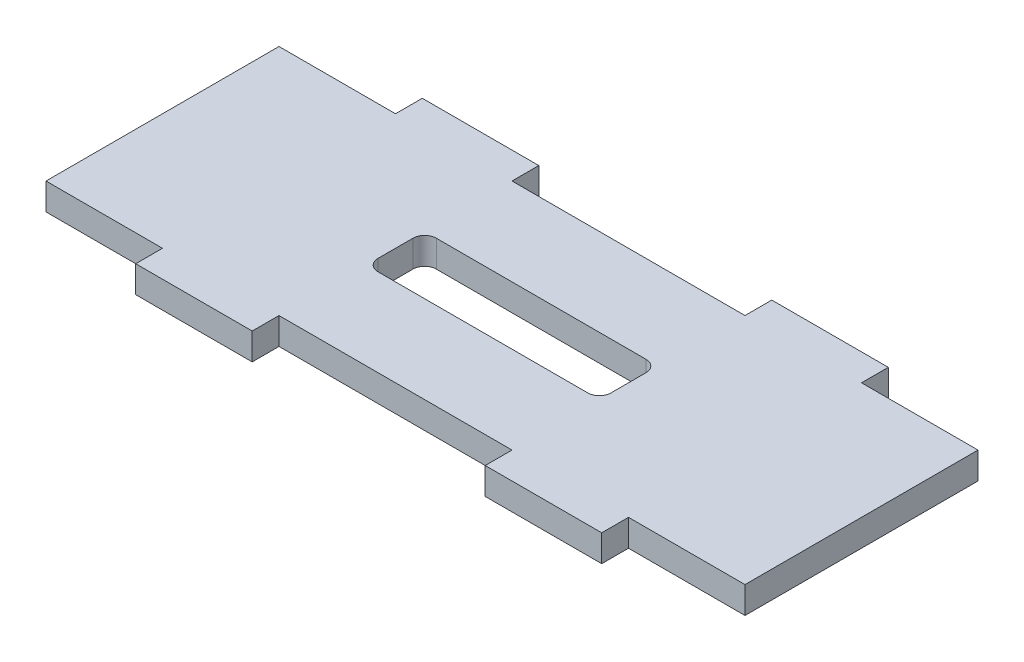
ISO-10303-21;
HEADER;
FILE_DESCRIPTION(('STEP AP214'),'2;1');
FILE_NAME('part.step','',(''),(''),'','','');
FILE_SCHEMA(('AUTOMOTIVE_DESIGN { 1 0 10303 214 1 1 1 1 }'));
ENDSEC;
DATA;
#1=APPLICATION_CONTEXT('core data for automotive mechanical design processes');
#2=APPLICATION_PROTOCOL_DEFINITION('international standard','automotive_design',2000,#1);
#3=PRODUCT_CONTEXT('',#1,'mechanical');
#4=PRODUCT('Part','Part','',(#3));
#5=PRODUCT_RELATED_PRODUCT_CATEGORY('part','',(#4));
#6=PRODUCT_DEFINITION_FORMATION('','',#4);
#7=PRODUCT_DEFINITION_CONTEXT('part definition',#1,'design');
#8=PRODUCT_DEFINITION('design','',#6,#7);
#9=PRODUCT_DEFINITION_SHAPE('','',#8);
#10=(LENGTH_UNIT() NAMED_UNIT(*) SI_UNIT(.MILLI.,.METRE.));
#11=(NAMED_UNIT(*) PLANE_ANGLE_UNIT() SI_UNIT($,.RADIAN.));
#12=(NAMED_UNIT(*) SI_UNIT($,.STERADIAN.) SOLID_ANGLE_UNIT());
#13=UNCERTAINTY_MEASURE_WITH_UNIT(LENGTH_MEASURE(1.E-05),#10,'distance_accuracy_value','');
#14=(GEOMETRIC_REPRESENTATION_CONTEXT(3) GLOBAL_UNCERTAINTY_ASSIGNED_CONTEXT((#13)) GLOBAL_UNIT_ASSIGNED_CONTEXT((#10,
#11,#12)) REPRESENTATION_CONTEXT('',''));
#15=CARTESIAN_POINT('',(0.,0.,0.));
#16=DIRECTION('',(0.,0.,1.));
#17=DIRECTION('',(1.,0.,0.));
#18=AXIS2_PLACEMENT_3D('',#15,#16,#17);
#19=CARTESIAN_POINT('',(0.,2.3,0.));
#20=DIRECTION('',(0.,0.,-1.));
#21=DIRECTION('',(-1.,0.,0.));
#22=AXIS2_PLACEMENT_3D('',#19,#20,#21);
#23=PLANE('',#22);
#24=DIRECTION('',(1.,0.,0.));
#25=VECTOR('',#24,1.);
#26=CARTESIAN_POINT('',(0.,0.,0.));
#27=LINE('',#26,#25);
#28=CARTESIAN_POINT('',(0.,0.,0.));
#29=VERTEX_POINT('',#28);
#30=CARTESIAN_POINT('',(10.,0.,0.));
#31=VERTEX_POINT('',#30);
#32=EDGE_CURVE('E240',#29,#31,#27,.T.);
#33=ORIENTED_EDGE('',*,*,#32,.T.);
#34=DIRECTION('',(0.,-1.,0.));
#35=VECTOR('',#34,1.);
#36=CARTESIAN_POINT('',(10.,2.3,0.));
#37=LINE('',#36,#35);
#38=CARTESIAN_POINT('',(10.,2.3,0.));
#39=VERTEX_POINT('',#38);
#40=EDGE_CURVE('E221',#39,#31,#37,.T.);
#41=ORIENTED_EDGE('',*,*,#40,.F.);
#42=DIRECTION('',(1.,0.,0.));
#43=VECTOR('',#42,1.);
#44=CARTESIAN_POINT('',(0.,2.3,0.));
#45=LINE('',#44,#43);
#46=CARTESIAN_POINT('',(0.,2.3,0.));
#47=VERTEX_POINT('',#46);
#48=EDGE_CURVE('E228',#47,#39,#45,.T.);
#49=ORIENTED_EDGE('',*,*,#48,.F.);
#50=DIRECTION('',(0.,-1.,0.));
#51=VECTOR('',#50,1.);
#52=CARTESIAN_POINT('',(0.,2.3,0.));
#53=LINE('',#52,#51);
#54=EDGE_CURVE('E367',#47,#29,#53,.T.);
#55=ORIENTED_EDGE('',*,*,#54,.T.);
#56=EDGE_LOOP('',(#33,#41,#49,#55));
#57=FACE_BOUND('',#56,.T.);
#58=ADVANCED_FACE('F32',(#57),#23,.F.);
#59=CARTESIAN_POINT('',(10.,2.3,0.));
#60=DIRECTION('',(1.,0.,0.));
#61=DIRECTION('',(0.,0.,-1.));
#62=AXIS2_PLACEMENT_3D('',#59,#60,#61);
#63=PLANE('',#62);
#64=DIRECTION('',(0.,0.,1.));
#65=VECTOR('',#64,1.);
#66=CARTESIAN_POINT('',(10.,0.,0.));
#67=LINE('',#66,#65);
#68=CARTESIAN_POINT('',(10.,0.,2.3));
#69=VERTEX_POINT('',#68);
#70=EDGE_CURVE('E329',#31,#69,#67,.T.);
#71=ORIENTED_EDGE('',*,*,#70,.T.);
#72=DIRECTION('',(0.,-1.,0.));
#73=VECTOR('',#72,1.);
#74=CARTESIAN_POINT('',(10.,2.3,2.3));
#75=LINE('',#74,#73);
#76=CARTESIAN_POINT('',(10.,2.3,2.3));
#77=VERTEX_POINT('',#76);
#78=EDGE_CURVE('E224',#77,#69,#75,.T.);
#79=ORIENTED_EDGE('',*,*,#78,.F.);
#80=DIRECTION('',(0.,0.,1.));
#81=VECTOR('',#80,1.);
#82=CARTESIAN_POINT('',(10.,2.3,0.));
#83=LINE('',#82,#81);
#84=EDGE_CURVE('E217',#39,#77,#83,.T.);
#85=ORIENTED_EDGE('',*,*,#84,.F.);
#86=ORIENTED_EDGE('',*,*,#40,.T.);
#87=EDGE_LOOP('',(#71,#79,#85,#86));
#88=FACE_BOUND('',#87,.T.);
#89=ADVANCED_FACE('F219',(#88),#63,.F.);
#90=CARTESIAN_POINT('',(10.,2.3,2.3));
#91=DIRECTION('',(0.,0.,-1.));
#92=DIRECTION('',(-1.,0.,0.));
#93=AXIS2_PLACEMENT_3D('',#90,#91,#92);
#94=PLANE('',#93);
#95=DIRECTION('',(1.,0.,0.));
#96=VECTOR('',#95,1.);
#97=CARTESIAN_POINT('',(10.,0.,2.3));
#98=LINE('',#97,#96);
#99=CARTESIAN_POINT('',(20.,0.,2.3));
#100=VERTEX_POINT('',#99);
#101=EDGE_CURVE('E370',#69,#100,#98,.T.);
#102=ORIENTED_EDGE('',*,*,#101,.T.);
#103=DIRECTION('',(0.,-1.,0.));
#104=VECTOR('',#103,1.);
#105=CARTESIAN_POINT('',(20.,2.3,2.3));
#106=LINE('',#105,#104);
#107=CARTESIAN_POINT('',(20.,2.3,2.3));
#108=VERTEX_POINT('',#107);
#109=EDGE_CURVE('E246',#108,#100,#106,.T.);
#110=ORIENTED_EDGE('',*,*,#109,.F.);
#111=DIRECTION('',(1.,0.,0.));
#112=VECTOR('',#111,1.);
#113=CARTESIAN_POINT('',(10.,2.3,2.3));
#114=LINE('',#113,#112);
#115=EDGE_CURVE('E227',#77,#108,#114,.T.);
#116=ORIENTED_EDGE('',*,*,#115,.F.);
#117=ORIENTED_EDGE('',*,*,#78,.T.);
#118=EDGE_LOOP('',(#102,#110,#116,#117));
#119=FACE_BOUND('',#118,.T.);
#120=ADVANCED_FACE('F475',(#119),#94,.F.);
#121=CARTESIAN_POINT('',(20.,2.3,2.3));
#122=DIRECTION('',(-1.,0.,0.));
#123=DIRECTION('',(0.,0.,1.));
#124=AXIS2_PLACEMENT_3D('',#121,#122,#123);
#125=PLANE('',#124);
#126=DIRECTION('',(0.,0.,-1.));
#127=VECTOR('',#126,1.);
#128=CARTESIAN_POINT('',(20.,0.,2.3));
#129=LINE('',#128,#127);
#130=CARTESIAN_POINT('',(20.,0.,0.));
#131=VERTEX_POINT('',#130);
#132=EDGE_CURVE('E372',#100,#131,#129,.T.);
#133=ORIENTED_EDGE('',*,*,#132,.T.);
#134=DIRECTION('',(0.,-1.,0.));
#135=VECTOR('',#134,1.);
#136=CARTESIAN_POINT('',(20.,2.3,0.));
#137=LINE('',#136,#135);
#138=CARTESIAN_POINT('',(20.,2.3,0.));
#139=VERTEX_POINT('',#138);
#140=EDGE_CURVE('E451',#139,#131,#137,.T.);
#141=ORIENTED_EDGE('',*,*,#140,.F.);
#142=DIRECTION('',(0.,0.,-1.));
#143=VECTOR('',#142,1.);
#144=CARTESIAN_POINT('',(20.,2.3,2.3));
#145=LINE('',#144,#143);
#146=EDGE_CURVE('E335',#108,#139,#145,.T.);
#147=ORIENTED_EDGE('',*,*,#146,.F.);
#148=ORIENTED_EDGE('',*,*,#109,.T.);
#149=EDGE_LOOP('',(#133,#141,#147,#148));
#150=FACE_BOUND('',#149,.T.);
#151=ADVANCED_FACE('F458',(#150),#125,.F.);
#152=CARTESIAN_POINT('',(20.,2.3,0.));
#153=DIRECTION('',(0.,0.,-1.));
#154=DIRECTION('',(-1.,0.,0.));
#155=AXIS2_PLACEMENT_3D('',#152,#153,#154);
#156=PLANE('',#155);
#157=DIRECTION('',(1.,0.,0.));
#158=VECTOR('',#157,1.);
#159=CARTESIAN_POINT('',(20.,0.,0.));
#160=LINE('',#159,#158);
#161=CARTESIAN_POINT('',(40.,0.,0.));
#162=VERTEX_POINT('',#161);
#163=EDGE_CURVE('E374',#131,#162,#160,.T.);
#164=ORIENTED_EDGE('',*,*,#163,.T.);
#165=DIRECTION('',(0.,-1.,0.));
#166=VECTOR('',#165,1.);
#167=CARTESIAN_POINT('',(40.,2.3,0.));
#168=LINE('',#167,#166);
#169=CARTESIAN_POINT('',(40.,2.3,0.));
#170=VERTEX_POINT('',#169);
#171=EDGE_CURVE('E448',#170,#162,#168,.T.);
#172=ORIENTED_EDGE('',*,*,#171,.F.);
#173=DIRECTION('',(1.,0.,0.));
#174=VECTOR('',#173,1.);
#175=CARTESIAN_POINT('',(20.,2.3,0.));
#176=LINE('',#175,#174);
#177=EDGE_CURVE('E337',#139,#170,#176,.T.);
#178=ORIENTED_EDGE('',*,*,#177,.F.);
#179=ORIENTED_EDGE('',*,*,#140,.T.);
#180=EDGE_LOOP('',(#164,#172,#178,#179));
#181=FACE_BOUND('',#180,.T.);
#182=ADVANCED_FACE('F467',(#181),#156,.F.);
#183=CARTESIAN_POINT('',(40.,2.3,0.));
#184=DIRECTION('',(1.,0.,0.));
#185=DIRECTION('',(0.,0.,-1.));
#186=AXIS2_PLACEMENT_3D('',#183,#184,#185);
#187=PLANE('',#186);
#188=DIRECTION('',(0.,0.,1.));
#189=VECTOR('',#188,1.);
#190=CARTESIAN_POINT('',(40.,0.,0.));
#191=LINE('',#190,#189);
#192=CARTESIAN_POINT('',(40.,0.,2.3));
#193=VERTEX_POINT('',#192);
#194=EDGE_CURVE('E376',#162,#193,#191,.T.);
#195=ORIENTED_EDGE('',*,*,#194,.T.);
#196=DIRECTION('',(0.,-1.,0.));
#197=VECTOR('',#196,1.);
#198=CARTESIAN_POINT('',(40.,2.3,2.3));
#199=LINE('',#198,#197);
#200=CARTESIAN_POINT('',(40.,2.3,2.3));
#201=VERTEX_POINT('',#200);
#202=EDGE_CURVE('E445',#201,#193,#199,.T.);
#203=ORIENTED_EDGE('',*,*,#202,.F.);
#204=DIRECTION('',(0.,0.,1.));
#205=VECTOR('',#204,1.);
#206=CARTESIAN_POINT('',(40.,2.3,0.));
#207=LINE('',#206,#205);
#208=EDGE_CURVE('E339',#170,#201,#207,.T.);
#209=ORIENTED_EDGE('',*,*,#208,.F.);
#210=ORIENTED_EDGE('',*,*,#171,.T.);
#211=EDGE_LOOP('',(#195,#203,#209,#210));
#212=FACE_BOUND('',#211,.T.);
#213=ADVANCED_FACE('F471',(#212),#187,.F.);
#214=CARTESIAN_POINT('',(40.,2.3,2.3));
#215=DIRECTION('',(0.,0.,-1.));
#216=DIRECTION('',(-1.,0.,0.));
#217=AXIS2_PLACEMENT_3D('',#214,#215,#216);
#218=PLANE('',#217);
#219=DIRECTION('',(1.,0.,0.));
#220=VECTOR('',#219,1.);
#221=CARTESIAN_POINT('',(40.,0.,2.3));
#222=LINE('',#221,#220);
#223=CARTESIAN_POINT('',(50.,0.,2.3));
#224=VERTEX_POINT('',#223);
#225=EDGE_CURVE('E378',#193,#224,#222,.T.);
#226=ORIENTED_EDGE('',*,*,#225,.T.);
#227=DIRECTION('',(0.,-1.,0.));
#228=VECTOR('',#227,1.);
#229=CARTESIAN_POINT('',(50.,2.3,2.3));
#230=LINE('',#229,#228);
#231=CARTESIAN_POINT('',(50.,2.3,2.3));
#232=VERTEX_POINT('',#231);
#233=EDGE_CURVE('E442',#232,#224,#230,.T.);
#234=ORIENTED_EDGE('',*,*,#233,.F.);
#235=DIRECTION('',(1.,0.,0.));
#236=VECTOR('',#235,1.);
#237=CARTESIAN_POINT('',(40.,2.3,2.3));
#238=LINE('',#237,#236);
#239=EDGE_CURVE('E341',#201,#232,#238,.T.);
#240=ORIENTED_EDGE('',*,*,#239,.F.);
#241=ORIENTED_EDGE('',*,*,#202,.T.);
#242=EDGE_LOOP('',(#226,#234,#240,#241));
#243=FACE_BOUND('',#242,.T.);
#244=ADVANCED_FACE('F692',(#243),#218,.F.);
#245=CARTESIAN_POINT('',(50.,2.3,2.3));
#246=DIRECTION('',(-1.,0.,0.));
#247=DIRECTION('',(0.,0.,1.));
#248=AXIS2_PLACEMENT_3D('',#245,#246,#247);
#249=PLANE('',#248);
#250=DIRECTION('',(0.,0.,-1.));
#251=VECTOR('',#250,1.);
#252=CARTESIAN_POINT('',(50.,0.,2.3));
#253=LINE('',#252,#251);
#254=CARTESIAN_POINT('',(50.,0.,0.));
#255=VERTEX_POINT('',#254);
#256=EDGE_CURVE('E380',#224,#255,#253,.T.);
#257=ORIENTED_EDGE('',*,*,#256,.T.);
#258=DIRECTION('',(0.,-1.,0.));
#259=VECTOR('',#258,1.);
#260=CARTESIAN_POINT('',(50.,2.3,0.));
#261=LINE('',#260,#259);
#262=CARTESIAN_POINT('',(50.,2.3,0.));
#263=VERTEX_POINT('',#262);
#264=EDGE_CURVE('E439',#263,#255,#261,.T.);
#265=ORIENTED_EDGE('',*,*,#264,.F.);
#266=DIRECTION('',(0.,0.,-1.));
#267=VECTOR('',#266,1.);
#268=CARTESIAN_POINT('',(50.,2.3,2.3));
#269=LINE('',#268,#267);
#270=EDGE_CURVE('E343',#232,#263,#269,.T.);
#271=ORIENTED_EDGE('',*,*,#270,.F.);
#272=ORIENTED_EDGE('',*,*,#233,.T.);
#273=EDGE_LOOP('',(#257,#265,#271,#272));
#274=FACE_BOUND('',#273,.T.);
#275=ADVANCED_FACE('F682',(#274),#249,.F.);
#276=CARTESIAN_POINT('',(50.,2.3,0.));
#277=DIRECTION('',(0.,0.,-1.));
#278=DIRECTION('',(-1.,0.,0.));
#279=AXIS2_PLACEMENT_3D('',#276,#277,#278);
#280=PLANE('',#279);
#281=DIRECTION('',(1.,0.,0.));
#282=VECTOR('',#281,1.);
#283=CARTESIAN_POINT('',(50.,0.,0.));
#284=LINE('',#283,#282);
#285=CARTESIAN_POINT('',(60.,0.,0.));
#286=VERTEX_POINT('',#285);
#287=EDGE_CURVE('E382',#255,#286,#284,.T.);
#288=ORIENTED_EDGE('',*,*,#287,.T.);
#289=DIRECTION('',(0.,-1.,0.));
#290=VECTOR('',#289,1.);
#291=CARTESIAN_POINT('',(60.,2.3,0.));
#292=LINE('',#291,#290);
#293=CARTESIAN_POINT('',(60.,2.3,0.));
#294=VERTEX_POINT('',#293);
#295=EDGE_CURVE('E436',#294,#286,#292,.T.);
#296=ORIENTED_EDGE('',*,*,#295,.F.);
#297=DIRECTION('',(1.,0.,0.));
#298=VECTOR('',#297,1.);
#299=CARTESIAN_POINT('',(50.,2.3,0.));
#300=LINE('',#299,#298);
#301=EDGE_CURVE('E345',#263,#294,#300,.T.);
#302=ORIENTED_EDGE('',*,*,#301,.F.);
#303=ORIENTED_EDGE('',*,*,#264,.T.);
#304=EDGE_LOOP('',(#288,#296,#302,#303));
#305=FACE_BOUND('',#304,.T.);
#306=ADVANCED_FACE('F672',(#305),#280,.F.);
#307=CARTESIAN_POINT('',(60.,2.3,-20.));
#308=DIRECTION('',(-1.,0.,0.));
#309=DIRECTION('',(0.,0.,1.));
#310=AXIS2_PLACEMENT_3D('',#307,#308,#309);
#311=PLANE('',#310);
#312=DIRECTION('',(0.,0.,-1.));
#313=VECTOR('',#312,1.);
#314=CARTESIAN_POINT('',(60.,0.,-20.));
#315=LINE('',#314,#313);
#316=CARTESIAN_POINT('',(60.,0.,-20.));
#317=VERTEX_POINT('',#316);
#318=EDGE_CURVE('E384',#286,#317,#315,.T.);
#319=ORIENTED_EDGE('',*,*,#318,.T.);
#320=DIRECTION('',(0.,-1.,0.));
#321=VECTOR('',#320,1.);
#322=CARTESIAN_POINT('',(60.,2.3,-20.));
#323=LINE('',#322,#321);
#324=CARTESIAN_POINT('',(60.,2.3,-20.));
#325=VERTEX_POINT('',#324);
#326=EDGE_CURVE('E433',#325,#317,#323,.T.);
#327=ORIENTED_EDGE('',*,*,#326,.F.);
#328=DIRECTION('',(0.,0.,-1.));
#329=VECTOR('',#328,1.);
#330=CARTESIAN_POINT('',(60.,2.3,-20.));
#331=LINE('',#330,#329);
#332=EDGE_CURVE('E347',#294,#325,#331,.T.);
#333=ORIENTED_EDGE('',*,*,#332,.F.);
#334=ORIENTED_EDGE('',*,*,#295,.T.);
#335=EDGE_LOOP('',(#319,#327,#333,#334));
#336=FACE_BOUND('',#335,.T.);
#337=ADVANCED_FACE('F662',(#336),#311,.F.);
#338=CARTESIAN_POINT('',(50.,2.3,-20.));
#339=DIRECTION('',(0.,0.,1.));
#340=DIRECTION('',(1.,0.,0.));
#341=AXIS2_PLACEMENT_3D('',#338,#339,#340);
#342=PLANE('',#341);
#343=DIRECTION('',(-1.,0.,0.));
#344=VECTOR('',#343,1.);
#345=CARTESIAN_POINT('',(50.,0.,-20.));
#346=LINE('',#345,#344);
#347=CARTESIAN_POINT('',(50.,0.,-20.));
#348=VERTEX_POINT('',#347);
#349=EDGE_CURVE('E386',#317,#348,#346,.T.);
#350=ORIENTED_EDGE('',*,*,#349,.T.);
#351=DIRECTION('',(0.,-1.,0.));
#352=VECTOR('',#351,1.);
#353=CARTESIAN_POINT('',(50.,2.3,-20.));
#354=LINE('',#353,#352);
#355=CARTESIAN_POINT('',(50.,2.3,-20.));
#356=VERTEX_POINT('',#355);
#357=EDGE_CURVE('E430',#356,#348,#354,.T.);
#358=ORIENTED_EDGE('',*,*,#357,.F.);
#359=DIRECTION('',(-1.,0.,0.));
#360=VECTOR('',#359,1.);
#361=CARTESIAN_POINT('',(50.,2.3,-20.));
#362=LINE('',#361,#360);
#363=EDGE_CURVE('E349',#325,#356,#362,.T.);
#364=ORIENTED_EDGE('',*,*,#363,.F.);
#365=ORIENTED_EDGE('',*,*,#326,.T.);
#366=EDGE_LOOP('',(#350,#358,#364,#365));
#367=FACE_BOUND('',#366,.T.);
#368=ADVANCED_FACE('F652',(#367),#342,.F.);
#369=CARTESIAN_POINT('',(50.,2.3,-22.3));
#370=DIRECTION('',(-1.,0.,0.));
#371=DIRECTION('',(0.,0.,1.));
#372=AXIS2_PLACEMENT_3D('',#369,#370,#371);
#373=PLANE('',#372);
#374=DIRECTION('',(0.,0.,-1.));
#375=VECTOR('',#374,1.);
#376=CARTESIAN_POINT('',(50.,0.,-22.3));
#377=LINE('',#376,#375);
#378=CARTESIAN_POINT('',(50.,0.,-22.3));
#379=VERTEX_POINT('',#378);
#380=EDGE_CURVE('E388',#348,#379,#377,.T.);
#381=ORIENTED_EDGE('',*,*,#380,.T.);
#382=DIRECTION('',(0.,-1.,0.));
#383=VECTOR('',#382,1.);
#384=CARTESIAN_POINT('',(50.,2.3,-22.3));
#385=LINE('',#384,#383);
#386=CARTESIAN_POINT('',(50.,2.3,-22.3));
#387=VERTEX_POINT('',#386);
#388=EDGE_CURVE('E427',#387,#379,#385,.T.);
#389=ORIENTED_EDGE('',*,*,#388,.F.);
#390=DIRECTION('',(0.,0.,-1.));
#391=VECTOR('',#390,1.);
#392=CARTESIAN_POINT('',(50.,2.3,-22.3));
#393=LINE('',#392,#391);
#394=EDGE_CURVE('E351',#356,#387,#393,.T.);
#395=ORIENTED_EDGE('',*,*,#394,.F.);
#396=ORIENTED_EDGE('',*,*,#357,.T.);
#397=EDGE_LOOP('',(#381,#389,#395,#396));
#398=FACE_BOUND('',#397,.T.);
#399=ADVANCED_FACE('F642',(#398),#373,.F.);
#400=CARTESIAN_POINT('',(40.,2.3,-22.3));
#401=DIRECTION('',(0.,0.,1.));
#402=DIRECTION('',(1.,0.,0.));
#403=AXIS2_PLACEMENT_3D('',#400,#401,#402);
#404=PLANE('',#403);
#405=DIRECTION('',(-1.,0.,0.));
#406=VECTOR('',#405,1.);
#407=CARTESIAN_POINT('',(40.,0.,-22.3));
#408=LINE('',#407,#406);
#409=CARTESIAN_POINT('',(40.,0.,-22.3));
#410=VERTEX_POINT('',#409);
#411=EDGE_CURVE('E390',#379,#410,#408,.T.);
#412=ORIENTED_EDGE('',*,*,#411,.T.);
#413=DIRECTION('',(0.,-1.,0.));
#414=VECTOR('',#413,1.);
#415=CARTESIAN_POINT('',(40.,2.3,-22.3));
#416=LINE('',#415,#414);
#417=CARTESIAN_POINT('',(40.,2.3,-22.3));
#418=VERTEX_POINT('',#417);
#419=EDGE_CURVE('E424',#418,#410,#416,.T.);
#420=ORIENTED_EDGE('',*,*,#419,.F.);
#421=DIRECTION('',(-1.,0.,0.));
#422=VECTOR('',#421,1.);
#423=CARTESIAN_POINT('',(40.,2.3,-22.3));
#424=LINE('',#423,#422);
#425=EDGE_CURVE('E353',#387,#418,#424,.T.);
#426=ORIENTED_EDGE('',*,*,#425,.F.);
#427=ORIENTED_EDGE('',*,*,#388,.T.);
#428=EDGE_LOOP('',(#412,#420,#426,#427));
#429=FACE_BOUND('',#428,.T.);
#430=ADVANCED_FACE('F632',(#429),#404,.F.);
#431=CARTESIAN_POINT('',(40.,2.3,-20.));
#432=DIRECTION('',(1.,0.,0.));
#433=DIRECTION('',(0.,0.,-1.));
#434=AXIS2_PLACEMENT_3D('',#431,#432,#433);
#435=PLANE('',#434);
#436=DIRECTION('',(0.,0.,1.));
#437=VECTOR('',#436,1.);
#438=CARTESIAN_POINT('',(40.,0.,-20.));
#439=LINE('',#438,#437);
#440=CARTESIAN_POINT('',(40.,0.,-20.));
#441=VERTEX_POINT('',#440);
#442=EDGE_CURVE('E392',#410,#441,#439,.T.);
#443=ORIENTED_EDGE('',*,*,#442,.T.);
#444=DIRECTION('',(0.,-1.,0.));
#445=VECTOR('',#444,1.);
#446=CARTESIAN_POINT('',(40.,2.3,-20.));
#447=LINE('',#446,#445);
#448=CARTESIAN_POINT('',(40.,2.3,-20.));
#449=VERTEX_POINT('',#448);
#450=EDGE_CURVE('E421',#449,#441,#447,.T.);
#451=ORIENTED_EDGE('',*,*,#450,.F.);
#452=DIRECTION('',(0.,0.,1.));
#453=VECTOR('',#452,1.);
#454=CARTESIAN_POINT('',(40.,2.3,-20.));
#455=LINE('',#454,#453);
#456=EDGE_CURVE('E355',#418,#449,#455,.T.);
#457=ORIENTED_EDGE('',*,*,#456,.F.);
#458=ORIENTED_EDGE('',*,*,#419,.T.);
#459=EDGE_LOOP('',(#443,#451,#457,#458));
#460=FACE_BOUND('',#459,.T.);
#461=ADVANCED_FACE('F622',(#460),#435,.F.);
#462=CARTESIAN_POINT('',(20.,2.3,-20.));
#463=DIRECTION('',(0.,0.,1.));
#464=DIRECTION('',(1.,0.,0.));
#465=AXIS2_PLACEMENT_3D('',#462,#463,#464);
#466=PLANE('',#465);
#467=DIRECTION('',(-1.,0.,0.));
#468=VECTOR('',#467,1.);
#469=CARTESIAN_POINT('',(20.,0.,-20.));
#470=LINE('',#469,#468);
#471=CARTESIAN_POINT('',(20.,0.,-20.));
#472=VERTEX_POINT('',#471);
#473=EDGE_CURVE('E394',#441,#472,#470,.T.);
#474=ORIENTED_EDGE('',*,*,#473,.T.);
#475=DIRECTION('',(0.,-1.,0.));
#476=VECTOR('',#475,1.);
#477=CARTESIAN_POINT('',(20.,2.3,-20.));
#478=LINE('',#477,#476);
#479=CARTESIAN_POINT('',(20.,2.3,-20.));
#480=VERTEX_POINT('',#479);
#481=EDGE_CURVE('E418',#480,#472,#478,.T.);
#482=ORIENTED_EDGE('',*,*,#481,.F.);
#483=DIRECTION('',(-1.,0.,0.));
#484=VECTOR('',#483,1.);
#485=CARTESIAN_POINT('',(20.,2.3,-20.));
#486=LINE('',#485,#484);
#487=EDGE_CURVE('E357',#449,#480,#486,.T.);
#488=ORIENTED_EDGE('',*,*,#487,.F.);
#489=ORIENTED_EDGE('',*,*,#450,.T.);
#490=EDGE_LOOP('',(#474,#482,#488,#489));
#491=FACE_BOUND('',#490,.T.);
#492=ADVANCED_FACE('F612',(#491),#466,.F.);
#493=CARTESIAN_POINT('',(20.,2.3,-22.3));
#494=DIRECTION('',(-1.,0.,0.));
#495=DIRECTION('',(0.,0.,1.));
#496=AXIS2_PLACEMENT_3D('',#493,#494,#495);
#497=PLANE('',#496);
#498=DIRECTION('',(0.,0.,-1.));
#499=VECTOR('',#498,1.);
#500=CARTESIAN_POINT('',(20.,0.,-22.3));
#501=LINE('',#500,#499);
#502=CARTESIAN_POINT('',(20.,0.,-22.3));
#503=VERTEX_POINT('',#502);
#504=EDGE_CURVE('E396',#472,#503,#501,.T.);
#505=ORIENTED_EDGE('',*,*,#504,.T.);
#506=DIRECTION('',(0.,-1.,0.));
#507=VECTOR('',#506,1.);
#508=CARTESIAN_POINT('',(20.,2.3,-22.3));
#509=LINE('',#508,#507);
#510=CARTESIAN_POINT('',(20.,2.3,-22.3));
#511=VERTEX_POINT('',#510);
#512=EDGE_CURVE('E415',#511,#503,#509,.T.);
#513=ORIENTED_EDGE('',*,*,#512,.F.);
#514=DIRECTION('',(0.,0.,-1.));
#515=VECTOR('',#514,1.);
#516=CARTESIAN_POINT('',(20.,2.3,-22.3));
#517=LINE('',#516,#515);
#518=EDGE_CURVE('E359',#480,#511,#517,.T.);
#519=ORIENTED_EDGE('',*,*,#518,.F.);
#520=ORIENTED_EDGE('',*,*,#481,.T.);
#521=EDGE_LOOP('',(#505,#513,#519,#520));
#522=FACE_BOUND('',#521,.T.);
#523=ADVANCED_FACE('F602',(#522),#497,.F.);
#524=CARTESIAN_POINT('',(10.,2.3,-22.3));
#525=DIRECTION('',(0.,0.,1.));
#526=DIRECTION('',(1.,0.,0.));
#527=AXIS2_PLACEMENT_3D('',#524,#525,#526);
#528=PLANE('',#527);
#529=DIRECTION('',(-1.,0.,0.));
#530=VECTOR('',#529,1.);
#531=CARTESIAN_POINT('',(10.,0.,-22.3));
#532=LINE('',#531,#530);
#533=CARTESIAN_POINT('',(10.,0.,-22.3));
#534=VERTEX_POINT('',#533);
#535=EDGE_CURVE('E398',#503,#534,#532,.T.);
#536=ORIENTED_EDGE('',*,*,#535,.T.);
#537=DIRECTION('',(0.,-1.,0.));
#538=VECTOR('',#537,1.);
#539=CARTESIAN_POINT('',(10.,2.3,-22.3));
#540=LINE('',#539,#538);
#541=CARTESIAN_POINT('',(10.,2.3,-22.3));
#542=VERTEX_POINT('',#541);
#543=EDGE_CURVE('E412',#542,#534,#540,.T.);
#544=ORIENTED_EDGE('',*,*,#543,.F.);
#545=DIRECTION('',(-1.,0.,0.));
#546=VECTOR('',#545,1.);
#547=CARTESIAN_POINT('',(10.,2.3,-22.3));
#548=LINE('',#547,#546);
#549=EDGE_CURVE('E361',#511,#542,#548,.T.);
#550=ORIENTED_EDGE('',*,*,#549,.F.);
#551=ORIENTED_EDGE('',*,*,#512,.T.);
#552=EDGE_LOOP('',(#536,#544,#550,#551));
#553=FACE_BOUND('',#552,.T.);
#554=ADVANCED_FACE('F592',(#553),#528,.F.);
#555=CARTESIAN_POINT('',(10.,2.3,-20.));
#556=DIRECTION('',(1.,0.,0.));
#557=DIRECTION('',(0.,0.,-1.));
#558=AXIS2_PLACEMENT_3D('',#555,#556,#557);
#559=PLANE('',#558);
#560=DIRECTION('',(0.,0.,1.));
#561=VECTOR('',#560,1.);
#562=CARTESIAN_POINT('',(10.,0.,-20.));
#563=LINE('',#562,#561);
#564=CARTESIAN_POINT('',(10.,0.,-20.));
#565=VERTEX_POINT('',#564);
#566=EDGE_CURVE('E400',#534,#565,#563,.T.);
#567=ORIENTED_EDGE('',*,*,#566,.T.);
#568=DIRECTION('',(0.,-1.,0.));
#569=VECTOR('',#568,1.);
#570=CARTESIAN_POINT('',(10.,2.3,-20.));
#571=LINE('',#570,#569);
#572=CARTESIAN_POINT('',(10.,2.3,-20.));
#573=VERTEX_POINT('',#572);
#574=EDGE_CURVE('E409',#573,#565,#571,.T.);
#575=ORIENTED_EDGE('',*,*,#574,.F.);
#576=DIRECTION('',(0.,0.,1.));
#577=VECTOR('',#576,1.);
#578=CARTESIAN_POINT('',(10.,2.3,-20.));
#579=LINE('',#578,#577);
#580=EDGE_CURVE('E363',#542,#573,#579,.T.);
#581=ORIENTED_EDGE('',*,*,#580,.F.);
#582=ORIENTED_EDGE('',*,*,#543,.T.);
#583=EDGE_LOOP('',(#567,#575,#581,#582));
#584=FACE_BOUND('',#583,.T.);
#585=ADVANCED_FACE('F582',(#584),#559,.F.);
#586=CARTESIAN_POINT('',(0.,2.3,-20.));
#587=DIRECTION('',(0.,0.,1.));
#588=DIRECTION('',(1.,0.,0.));
#589=AXIS2_PLACEMENT_3D('',#586,#587,#588);
#590=PLANE('',#589);
#591=DIRECTION('',(-1.,0.,0.));
#592=VECTOR('',#591,1.);
#593=CARTESIAN_POINT('',(0.,0.,-20.));
#594=LINE('',#593,#592);
#595=CARTESIAN_POINT('',(0.,0.,-20.));
#596=VERTEX_POINT('',#595);
#597=EDGE_CURVE('E402',#565,#596,#594,.T.);
#598=ORIENTED_EDGE('',*,*,#597,.T.);
#599=DIRECTION('',(0.,-1.,0.));
#600=VECTOR('',#599,1.);
#601=CARTESIAN_POINT('',(0.,2.3,-20.));
#602=LINE('',#601,#600);
#603=CARTESIAN_POINT('',(0.,2.3,-20.));
#604=VERTEX_POINT('',#603);
#605=EDGE_CURVE('E406',#604,#596,#602,.T.);
#606=ORIENTED_EDGE('',*,*,#605,.F.);
#607=DIRECTION('',(-1.,0.,0.));
#608=VECTOR('',#607,1.);
#609=CARTESIAN_POINT('',(0.,2.3,-20.));
#610=LINE('',#609,#608);
#611=EDGE_CURVE('E365',#573,#604,#610,.T.);
#612=ORIENTED_EDGE('',*,*,#611,.F.);
#613=ORIENTED_EDGE('',*,*,#574,.T.);
#614=EDGE_LOOP('',(#598,#606,#612,#613));
#615=FACE_BOUND('',#614,.T.);
#616=ADVANCED_FACE('F572',(#615),#590,.F.);
#617=CARTESIAN_POINT('',(0.,2.3,0.));
#618=DIRECTION('',(1.,0.,0.));
#619=DIRECTION('',(0.,0.,-1.));
#620=AXIS2_PLACEMENT_3D('',#617,#618,#619);
#621=PLANE('',#620);
#622=DIRECTION('',(0.,0.,1.));
#623=VECTOR('',#622,1.);
#624=CARTESIAN_POINT('',(0.,0.,0.));
#625=LINE('',#624,#623);
#626=EDGE_CURVE('E237',#596,#29,#625,.T.);
#627=ORIENTED_EDGE('',*,*,#626,.T.);
#628=ORIENTED_EDGE('',*,*,#54,.F.);
#629=DIRECTION('',(0.,0.,1.));
#630=VECTOR('',#629,1.);
#631=CARTESIAN_POINT('',(0.,2.3,0.));
#632=LINE('',#631,#630);
#633=EDGE_CURVE('E233',#604,#47,#632,.T.);
#634=ORIENTED_EDGE('',*,*,#633,.F.);
#635=ORIENTED_EDGE('',*,*,#605,.T.);
#636=EDGE_LOOP('',(#627,#628,#634,#635));
#637=FACE_BOUND('',#636,.T.);
#638=ADVANCED_FACE('F563',(#637),#621,.F.);
#639=CARTESIAN_POINT('',(0.,2.3,0.));
#640=DIRECTION('',(0.,-1.,0.));
#641=DIRECTION('',(0.,0.,-1.));
#642=AXIS2_PLACEMENT_3D('',#639,#640,#641);
#643=PLANE('',#642);
#644=DIRECTION('',(0.,0.,1.));
#645=VECTOR('',#644,1.);
#646=CARTESIAN_POINT('',(20.,2.3,-12.5));
#647=LINE('',#646,#645);
#648=CARTESIAN_POINT('',(20.,2.3,-11.5));
#649=VERTEX_POINT('',#648);
#650=CARTESIAN_POINT('',(20.,2.3,-8.50000000000001));
#651=VERTEX_POINT('',#650);
#652=EDGE_CURVE('E290',#649,#651,#647,.T.);
#653=ORIENTED_EDGE('',*,*,#652,.F.);
#654=CARTESIAN_POINT('',(21.,2.3,-11.5));
#655=DIRECTION('',(0.,-1.,0.));
#656=DIRECTION('',(0.,0.,-1.));
#657=AXIS2_PLACEMENT_3D('',#654,#655,#656);
#658=CIRCLE('',#657,1.);
#659=CARTESIAN_POINT('',(21.,2.3,-12.5));
#660=VERTEX_POINT('',#659);
#661=EDGE_CURVE('E40',#649,#660,#658,.T.);
#662=ORIENTED_EDGE('',*,*,#661,.T.);
#663=DIRECTION('',(-1.,0.,0.));
#664=VECTOR('',#663,1.);
#665=CARTESIAN_POINT('',(20.,2.3,-12.5));
#666=LINE('',#665,#664);
#667=CARTESIAN_POINT('',(39.,2.3,-12.5));
#668=VERTEX_POINT('',#667);
#669=EDGE_CURVE('E289',#668,#660,#666,.T.);
#670=ORIENTED_EDGE('',*,*,#669,.F.);
#671=CARTESIAN_POINT('',(39.,2.3,-11.5));
#672=DIRECTION('',(0.,-1.,0.));
#673=DIRECTION('',(0.,0.,-1.));
#674=AXIS2_PLACEMENT_3D('',#671,#672,#673);
#675=CIRCLE('',#674,1.);
#676=CARTESIAN_POINT('',(40.,2.3,-11.5));
#677=VERTEX_POINT('',#676);
#678=EDGE_CURVE('E281',#668,#677,#675,.T.);
#679=ORIENTED_EDGE('',*,*,#678,.T.);
#680=DIRECTION('',(0.,0.,-1.));
#681=VECTOR('',#680,1.);
#682=CARTESIAN_POINT('',(40.,2.3,-12.5));
#683=LINE('',#682,#681);
#684=CARTESIAN_POINT('',(40.,2.3,-8.50000000000001));
#685=VERTEX_POINT('',#684);
#686=EDGE_CURVE('E325',#685,#677,#683,.T.);
#687=ORIENTED_EDGE('',*,*,#686,.F.);
#688=CARTESIAN_POINT('',(39.,2.3,-8.50000000000001));
#689=DIRECTION('',(0.,-1.,0.));
#690=DIRECTION('',(0.,0.,-1.));
#691=AXIS2_PLACEMENT_3D('',#688,#689,#690);
#692=CIRCLE('',#691,1.);
#693=CARTESIAN_POINT('',(39.,2.3,-7.50000000000001));
#694=VERTEX_POINT('',#693);
#695=EDGE_CURVE('E277',#685,#694,#692,.T.);
#696=ORIENTED_EDGE('',*,*,#695,.T.);
#697=DIRECTION('',(1.,0.,0.));
#698=VECTOR('',#697,1.);
#699=CARTESIAN_POINT('',(20.,2.3,-7.50000000000001));
#700=LINE('',#699,#698);
#701=CARTESIAN_POINT('',(21.,2.3,-7.50000000000001));
#702=VERTEX_POINT('',#701);
#703=EDGE_CURVE('E314',#702,#694,#700,.T.);
#704=ORIENTED_EDGE('',*,*,#703,.F.);
#705=CARTESIAN_POINT('',(21.,2.3,-8.50000000000001));
#706=DIRECTION('',(0.,-1.,0.));
#707=DIRECTION('',(0.,0.,-1.));
#708=AXIS2_PLACEMENT_3D('',#705,#706,#707);
#709=CIRCLE('',#708,1.);
#710=EDGE_CURVE('E47',#702,#651,#709,.T.);
#711=ORIENTED_EDGE('',*,*,#710,.T.);
#712=EDGE_LOOP('',(#653,#662,#670,#679,#687,#696,#704,#711));
#713=FACE_BOUND('',#712,.T.);
#714=ORIENTED_EDGE('',*,*,#48,.T.);
#715=ORIENTED_EDGE('',*,*,#84,.T.);
#716=ORIENTED_EDGE('',*,*,#115,.T.);
#717=ORIENTED_EDGE('',*,*,#146,.T.);
#718=ORIENTED_EDGE('',*,*,#177,.T.);
#719=ORIENTED_EDGE('',*,*,#208,.T.);
#720=ORIENTED_EDGE('',*,*,#239,.T.);
#721=ORIENTED_EDGE('',*,*,#270,.T.);
#722=ORIENTED_EDGE('',*,*,#301,.T.);
#723=ORIENTED_EDGE('',*,*,#332,.T.);
#724=ORIENTED_EDGE('',*,*,#363,.T.);
#725=ORIENTED_EDGE('',*,*,#394,.T.);
#726=ORIENTED_EDGE('',*,*,#425,.T.);
#727=ORIENTED_EDGE('',*,*,#456,.T.);
#728=ORIENTED_EDGE('',*,*,#487,.T.);
#729=ORIENTED_EDGE('',*,*,#518,.T.);
#730=ORIENTED_EDGE('',*,*,#549,.T.);
#731=ORIENTED_EDGE('',*,*,#580,.T.);
#732=ORIENTED_EDGE('',*,*,#611,.T.);
#733=ORIENTED_EDGE('',*,*,#633,.T.);
#734=EDGE_LOOP('',(#714,#715,#716,#717,#718,#719,#720,#721,#722,#723,#724,#725,#726,#727,#728,
#729,#730,#731,#732,#733));
#735=FACE_BOUND('',#734,.T.);
#736=ADVANCED_FACE('F231',(#713,#735),#643,.F.);
#737=CARTESIAN_POINT('',(0.,0.,0.));
#738=DIRECTION('',(0.,-1.,0.));
#739=DIRECTION('',(0.,0.,-1.));
#740=AXIS2_PLACEMENT_3D('',#737,#738,#739);
#741=PLANE('',#740);
#742=DIRECTION('',(1.,0.,0.));
#743=VECTOR('',#742,1.);
#744=CARTESIAN_POINT('',(0.,0.,-12.5));
#745=LINE('',#744,#743);
#746=CARTESIAN_POINT('',(21.,0.,-12.5));
#747=VERTEX_POINT('',#746);
#748=CARTESIAN_POINT('',(39.,0.,-12.5));
#749=VERTEX_POINT('',#748);
#750=EDGE_CURVE('E255',#747,#749,#745,.T.);
#751=ORIENTED_EDGE('',*,*,#750,.F.);
#752=CARTESIAN_POINT('',(21.,0.,-11.5));
#753=DIRECTION('',(0.,-1.,0.));
#754=DIRECTION('',(0.,0.,-1.));
#755=AXIS2_PLACEMENT_3D('',#752,#753,#754);
#756=CIRCLE('',#755,1.);
#757=CARTESIAN_POINT('',(20.,0.,-11.5));
#758=VERTEX_POINT('',#757);
#759=EDGE_CURVE('E11',#747,#758,#756,.F.);
#760=ORIENTED_EDGE('',*,*,#759,.T.);
#761=DIRECTION('',(0.,0.,-1.));
#762=VECTOR('',#761,1.);
#763=CARTESIAN_POINT('',(20.,0.,0.));
#764=LINE('',#763,#762);
#765=CARTESIAN_POINT('',(20.,0.,-8.50000000000001));
#766=VERTEX_POINT('',#765);
#767=EDGE_CURVE('E241',#766,#758,#764,.T.);
#768=ORIENTED_EDGE('',*,*,#767,.F.);
#769=CARTESIAN_POINT('',(21.,0.,-8.50000000000001));
#770=DIRECTION('',(0.,-1.,0.));
#771=DIRECTION('',(0.,0.,-1.));
#772=AXIS2_PLACEMENT_3D('',#769,#770,#771);
#773=CIRCLE('',#772,1.);
#774=CARTESIAN_POINT('',(21.,0.,-7.50000000000001));
#775=VERTEX_POINT('',#774);
#776=EDGE_CURVE('E286',#766,#775,#773,.F.);
#777=ORIENTED_EDGE('',*,*,#776,.T.);
#778=DIRECTION('',(-1.,0.,0.));
#779=VECTOR('',#778,1.);
#780=CARTESIAN_POINT('',(0.,0.,-7.50000000000001));
#781=LINE('',#780,#779);
#782=CARTESIAN_POINT('',(39.,0.,-7.50000000000001));
#783=VERTEX_POINT('',#782);
#784=EDGE_CURVE('E244',#783,#775,#781,.T.);
#785=ORIENTED_EDGE('',*,*,#784,.F.);
#786=CARTESIAN_POINT('',(39.,0.,-8.50000000000001));
#787=DIRECTION('',(0.,-1.,0.));
#788=DIRECTION('',(0.,0.,-1.));
#789=AXIS2_PLACEMENT_3D('',#786,#787,#788);
#790=CIRCLE('',#789,1.);
#791=CARTESIAN_POINT('',(40.,0.,-8.50000000000001));
#792=VERTEX_POINT('',#791);
#793=EDGE_CURVE('E279',#783,#792,#790,.F.);
#794=ORIENTED_EDGE('',*,*,#793,.T.);
#795=DIRECTION('',(0.,0.,1.));
#796=VECTOR('',#795,1.);
#797=CARTESIAN_POINT('',(40.,0.,0.));
#798=LINE('',#797,#796);
#799=CARTESIAN_POINT('',(40.,0.,-11.5));
#800=VERTEX_POINT('',#799);
#801=EDGE_CURVE('E252',#800,#792,#798,.T.);
#802=ORIENTED_EDGE('',*,*,#801,.F.);
#803=CARTESIAN_POINT('',(39.,0.,-11.5));
#804=DIRECTION('',(0.,-1.,0.));
#805=DIRECTION('',(0.,0.,-1.));
#806=AXIS2_PLACEMENT_3D('',#803,#804,#805);
#807=CIRCLE('',#806,1.);
#808=EDGE_CURVE('E283',#800,#749,#807,.F.);
#809=ORIENTED_EDGE('',*,*,#808,.T.);
#810=EDGE_LOOP('',(#751,#760,#768,#777,#785,#794,#802,#809));
#811=FACE_BOUND('',#810,.T.);
#812=ORIENTED_EDGE('',*,*,#32,.F.);
#813=ORIENTED_EDGE('',*,*,#626,.F.);
#814=ORIENTED_EDGE('',*,*,#597,.F.);
#815=ORIENTED_EDGE('',*,*,#566,.F.);
#816=ORIENTED_EDGE('',*,*,#535,.F.);
#817=ORIENTED_EDGE('',*,*,#504,.F.);
#818=ORIENTED_EDGE('',*,*,#473,.F.);
#819=ORIENTED_EDGE('',*,*,#442,.F.);
#820=ORIENTED_EDGE('',*,*,#411,.F.);
#821=ORIENTED_EDGE('',*,*,#380,.F.);
#822=ORIENTED_EDGE('',*,*,#349,.F.);
#823=ORIENTED_EDGE('',*,*,#318,.F.);
#824=ORIENTED_EDGE('',*,*,#287,.F.);
#825=ORIENTED_EDGE('',*,*,#256,.F.);
#826=ORIENTED_EDGE('',*,*,#225,.F.);
#827=ORIENTED_EDGE('',*,*,#194,.F.);
#828=ORIENTED_EDGE('',*,*,#163,.F.);
#829=ORIENTED_EDGE('',*,*,#132,.F.);
#830=ORIENTED_EDGE('',*,*,#101,.F.);
#831=ORIENTED_EDGE('',*,*,#70,.F.);
#832=EDGE_LOOP('',(#812,#813,#814,#815,#816,#817,#818,#819,#820,#821,#822,#823,#824,#825,#826,
#827,#828,#829,#830,#831));
#833=FACE_BOUND('',#832,.T.);
#834=ADVANCED_FACE('F299',(#811,#833),#741,.T.);
#835=CARTESIAN_POINT('',(20.,-7.7,-12.5));
#836=DIRECTION('',(0.,0.,-1.));
#837=DIRECTION('',(-1.,0.,0.));
#838=AXIS2_PLACEMENT_3D('',#835,#836,#837);
#839=PLANE('',#838);
#840=ORIENTED_EDGE('',*,*,#750,.T.);
#841=DIRECTION('',(0.,1.,0.));
#842=VECTOR('',#841,1.);
#843=CARTESIAN_POINT('',(39.,2.3,-12.5));
#844=LINE('',#843,#842);
#845=EDGE_CURVE('E270',#749,#668,#844,.T.);
#846=ORIENTED_EDGE('',*,*,#845,.T.);
#847=ORIENTED_EDGE('',*,*,#669,.T.);
#848=DIRECTION('',(0.,1.,0.));
#849=VECTOR('',#848,1.);
#850=CARTESIAN_POINT('',(21.,0.,-12.5));
#851=LINE('',#850,#849);
#852=EDGE_CURVE('E268',#660,#747,#851,.F.);
#853=ORIENTED_EDGE('',*,*,#852,.T.);
#854=EDGE_LOOP('',(#840,#846,#847,#853));
#855=FACE_BOUND('',#854,.T.);
#856=ADVANCED_FACE('F292',(#855),#839,.F.);
#857=CARTESIAN_POINT('',(40.,-7.7,-12.5));
#858=DIRECTION('',(1.,0.,0.));
#859=DIRECTION('',(0.,0.,-1.));
#860=AXIS2_PLACEMENT_3D('',#857,#858,#859);
#861=PLANE('',#860);
#862=ORIENTED_EDGE('',*,*,#801,.T.);
#863=DIRECTION('',(0.,1.,0.));
#864=VECTOR('',#863,1.);
#865=CARTESIAN_POINT('',(40.,2.3,-8.50000000000001));
#866=LINE('',#865,#864);
#867=EDGE_CURVE('E260',#792,#685,#866,.T.);
#868=ORIENTED_EDGE('',*,*,#867,.T.);
#869=ORIENTED_EDGE('',*,*,#686,.T.);
#870=DIRECTION('',(0.,1.,0.));
#871=VECTOR('',#870,1.);
#872=CARTESIAN_POINT('',(40.,0.,-11.5));
#873=LINE('',#872,#871);
#874=EDGE_CURVE('E258',#677,#800,#873,.F.);
#875=ORIENTED_EDGE('',*,*,#874,.T.);
#876=EDGE_LOOP('',(#862,#868,#869,#875));
#877=FACE_BOUND('',#876,.T.);
#878=ADVANCED_FACE('F321',(#877),#861,.F.);
#879=CARTESIAN_POINT('',(20.,-7.7,-7.50000000000001));
#880=DIRECTION('',(0.,0.,1.));
#881=DIRECTION('',(1.,0.,0.));
#882=AXIS2_PLACEMENT_3D('',#879,#880,#881);
#883=PLANE('',#882);
#884=ORIENTED_EDGE('',*,*,#703,.T.);
#885=DIRECTION('',(0.,1.,0.));
#886=VECTOR('',#885,1.);
#887=CARTESIAN_POINT('',(39.,0.,-7.50000000000001));
#888=LINE('',#887,#886);
#889=EDGE_CURVE('E266',#694,#783,#888,.F.);
#890=ORIENTED_EDGE('',*,*,#889,.T.);
#891=ORIENTED_EDGE('',*,*,#784,.T.);
#892=DIRECTION('',(0.,1.,0.));
#893=VECTOR('',#892,1.);
#894=CARTESIAN_POINT('',(21.,2.3,-7.50000000000001));
#895=LINE('',#894,#893);
#896=EDGE_CURVE('E263',#775,#702,#895,.T.);
#897=ORIENTED_EDGE('',*,*,#896,.T.);
#898=EDGE_LOOP('',(#884,#890,#891,#897));
#899=FACE_BOUND('',#898,.T.);
#900=ADVANCED_FACE('F312',(#899),#883,.F.);
#901=CARTESIAN_POINT('',(20.,-7.7,-12.5));
#902=DIRECTION('',(-1.,0.,0.));
#903=DIRECTION('',(0.,0.,1.));
#904=AXIS2_PLACEMENT_3D('',#901,#902,#903);
#905=PLANE('',#904);
#906=ORIENTED_EDGE('',*,*,#652,.T.);
#907=DIRECTION('',(0.,1.,0.));
#908=VECTOR('',#907,1.);
#909=CARTESIAN_POINT('',(20.,0.,-8.50000000000001));
#910=LINE('',#909,#908);
#911=EDGE_CURVE('E275',#651,#766,#910,.F.);
#912=ORIENTED_EDGE('',*,*,#911,.T.);
#913=ORIENTED_EDGE('',*,*,#767,.T.);
#914=DIRECTION('',(0.,1.,0.));
#915=VECTOR('',#914,1.);
#916=CARTESIAN_POINT('',(20.,2.3,-11.5));
#917=LINE('',#916,#915);
#918=EDGE_CURVE('E273',#758,#649,#917,.T.);
#919=ORIENTED_EDGE('',*,*,#918,.T.);
#920=EDGE_LOOP('',(#906,#912,#913,#919));
#921=FACE_BOUND('',#920,.T.);
#922=ADVANCED_FACE('F303',(#921),#905,.F.);
#923=CARTESIAN_POINT('',(39.,-7.7,-8.50000000000001));
#924=DIRECTION('',(0.,-1.,0.));
#925=DIRECTION('',(0.,0.,-1.));
#926=AXIS2_PLACEMENT_3D('',#923,#924,#925);
#927=CYLINDRICAL_SURFACE('',#926,1.);
#928=ORIENTED_EDGE('',*,*,#793,.F.);
#929=ORIENTED_EDGE('',*,*,#889,.F.);
#930=ORIENTED_EDGE('',*,*,#695,.F.);
#931=ORIENTED_EDGE('',*,*,#867,.F.);
#932=EDGE_LOOP('',(#928,#929,#930,#931));
#933=FACE_BOUND('',#932,.T.);
#934=ADVANCED_FACE('F316',(#933),#927,.F.);
#935=CARTESIAN_POINT('',(39.,-7.7,-11.5));
#936=DIRECTION('',(0.,-1.,0.));
#937=DIRECTION('',(0.,0.,-1.));
#938=AXIS2_PLACEMENT_3D('',#935,#936,#937);
#939=CYLINDRICAL_SURFACE('',#938,1.);
#940=ORIENTED_EDGE('',*,*,#808,.F.);
#941=ORIENTED_EDGE('',*,*,#874,.F.);
#942=ORIENTED_EDGE('',*,*,#678,.F.);
#943=ORIENTED_EDGE('',*,*,#845,.F.);
#944=EDGE_LOOP('',(#940,#941,#942,#943));
#945=FACE_BOUND('',#944,.T.);
#946=ADVANCED_FACE('F327',(#945),#939,.F.);
#947=CARTESIAN_POINT('',(21.,-7.7,-8.50000000000001));
#948=DIRECTION('',(0.,-1.,0.));
#949=DIRECTION('',(0.,0.,-1.));
#950=AXIS2_PLACEMENT_3D('',#947,#948,#949);
#951=CYLINDRICAL_SURFACE('',#950,1.);
#952=ORIENTED_EDGE('',*,*,#776,.F.);
#953=ORIENTED_EDGE('',*,*,#911,.F.);
#954=ORIENTED_EDGE('',*,*,#710,.F.);
#955=ORIENTED_EDGE('',*,*,#896,.F.);
#956=EDGE_LOOP('',(#952,#953,#954,#955));
#957=FACE_BOUND('',#956,.T.);
#958=ADVANCED_FACE('F306',(#957),#951,.F.);
#959=CARTESIAN_POINT('',(21.,-7.7,-11.5));
#960=DIRECTION('',(0.,-1.,0.));
#961=DIRECTION('',(0.,0.,-1.));
#962=AXIS2_PLACEMENT_3D('',#959,#960,#961);
#963=CYLINDRICAL_SURFACE('',#962,1.);
#964=ORIENTED_EDGE('',*,*,#759,.F.);
#965=ORIENTED_EDGE('',*,*,#852,.F.);
#966=ORIENTED_EDGE('',*,*,#661,.F.);
#967=ORIENTED_EDGE('',*,*,#918,.F.);
#968=EDGE_LOOP('',(#964,#965,#966,#967));
#969=FACE_BOUND('',#968,.T.);
#970=ADVANCED_FACE('F34',(#969),#963,.F.);
#971=CLOSED_SHELL('',(#58,#89,#120,#151,#182,#213,#244,#275,#306,#337,#368,#399,#430,#461,#492,
#523,#554,#585,#616,#638,#736,#834,#856,#878,#900,#922,#934,#946,#958,#970));
#972=MANIFOLD_SOLID_BREP('B2',#971);
#973=ADVANCED_BREP_SHAPE_REPRESENTATION('',(#18,#972),#14);
#974=SHAPE_DEFINITION_REPRESENTATION(#9,#973);
ENDSEC;
END-ISO-10303-21;
